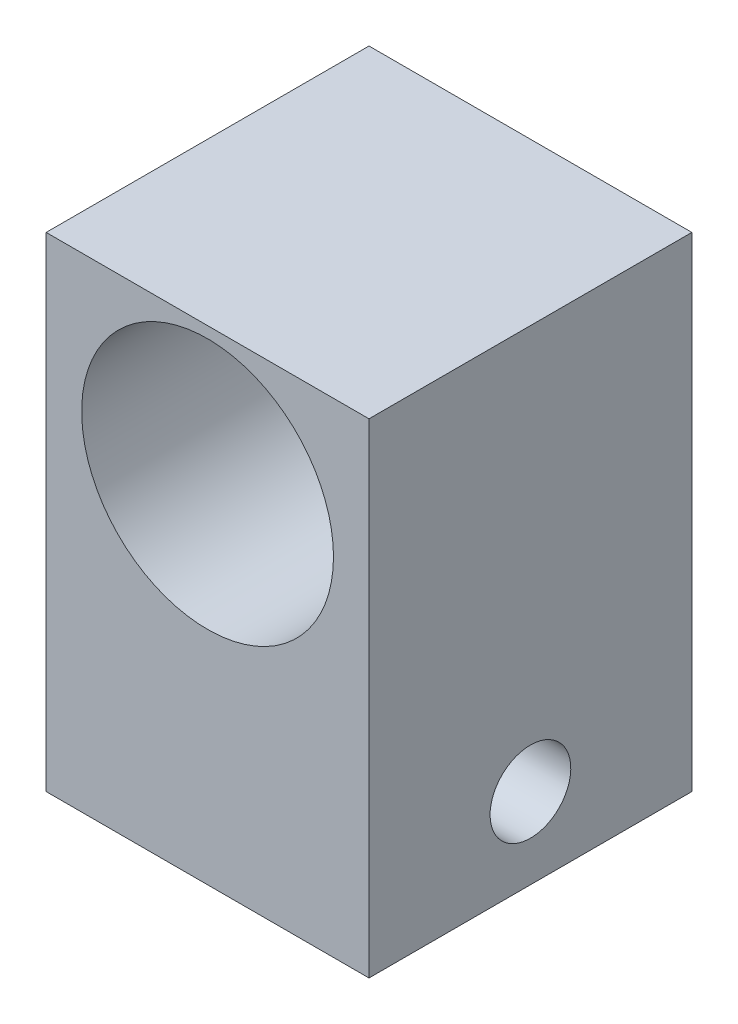
ISO-10303-21;
HEADER;
FILE_DESCRIPTION(('STEP AP214'),'2;1');
FILE_NAME('part.step','',(''),(''),'','','');
FILE_SCHEMA(('AUTOMOTIVE_DESIGN { 1 0 10303 214 1 1 1 1 }'));
ENDSEC;
DATA;
#1=APPLICATION_CONTEXT('core data for automotive mechanical design processes');
#2=APPLICATION_PROTOCOL_DEFINITION('international standard','automotive_design',2000,#1);
#3=PRODUCT_CONTEXT('',#1,'mechanical');
#4=PRODUCT('Part','Part','',(#3));
#5=PRODUCT_RELATED_PRODUCT_CATEGORY('part','',(#4));
#6=PRODUCT_DEFINITION_FORMATION('','',#4);
#7=PRODUCT_DEFINITION_CONTEXT('part definition',#1,'design');
#8=PRODUCT_DEFINITION('design','',#6,#7);
#9=PRODUCT_DEFINITION_SHAPE('','',#8);
#10=(LENGTH_UNIT() NAMED_UNIT(*) SI_UNIT(.MILLI.,.METRE.));
#11=(NAMED_UNIT(*) PLANE_ANGLE_UNIT() SI_UNIT($,.RADIAN.));
#12=(NAMED_UNIT(*) SI_UNIT($,.STERADIAN.) SOLID_ANGLE_UNIT());
#13=UNCERTAINTY_MEASURE_WITH_UNIT(LENGTH_MEASURE(1.E-05),#10,'distance_accuracy_value','');
#14=(GEOMETRIC_REPRESENTATION_CONTEXT(3) GLOBAL_UNCERTAINTY_ASSIGNED_CONTEXT((#13)) GLOBAL_UNIT_ASSIGNED_CONTEXT((#10,
#11,#12)) REPRESENTATION_CONTEXT('',''));
#15=CARTESIAN_POINT('',(0.,0.,0.));
#16=DIRECTION('',(0.,0.,1.));
#17=DIRECTION('',(1.,0.,0.));
#18=AXIS2_PLACEMENT_3D('',#15,#16,#17);
#19=CARTESIAN_POINT('',(-25.4,38.1,50.8));
#20=DIRECTION('',(1.,0.,0.));
#21=DIRECTION('',(0.,0.,-1.));
#22=AXIS2_PLACEMENT_3D('',#19,#20,#21);
#23=PLANE('',#22);
#24=CARTESIAN_POINT('',(-25.4,-25.4,25.4));
#25=DIRECTION('',(1.,0.,0.));
#26=DIRECTION('',(0.,1.,0.));
#27=AXIS2_PLACEMENT_3D('',#24,#25,#26);
#28=CIRCLE('',#27,6.35);
#29=CARTESIAN_POINT('',(-25.4,-19.05,25.4));
#30=VERTEX_POINT('',#29);
#31=EDGE_CURVE('E113',#30,#30,#28,.T.);
#32=ORIENTED_EDGE('',*,*,#31,.T.);
#33=EDGE_LOOP('',(#32));
#34=FACE_BOUND('',#33,.T.);
#35=DIRECTION('',(0.,-1.,0.));
#36=VECTOR('',#35,1.);
#37=CARTESIAN_POINT('',(-25.4,38.1,0.));
#38=LINE('',#37,#36);
#39=CARTESIAN_POINT('',(-25.4,38.1,0.));
#40=VERTEX_POINT('',#39);
#41=CARTESIAN_POINT('',(-25.4,-38.1,0.));
#42=VERTEX_POINT('',#41);
#43=EDGE_CURVE('E96',#40,#42,#38,.T.);
#44=ORIENTED_EDGE('',*,*,#43,.T.);
#45=DIRECTION('',(0.,0.,-1.));
#46=VECTOR('',#45,1.);
#47=CARTESIAN_POINT('',(-25.4,-38.1,50.8));
#48=LINE('',#47,#46);
#49=CARTESIAN_POINT('',(-25.4,-38.1,50.8));
#50=VERTEX_POINT('',#49);
#51=EDGE_CURVE('E11',#50,#42,#48,.T.);
#52=ORIENTED_EDGE('',*,*,#51,.F.);
#53=DIRECTION('',(0.,-1.,0.));
#54=VECTOR('',#53,1.);
#55=CARTESIAN_POINT('',(-25.4,38.1,50.8));
#56=LINE('',#55,#54);
#57=CARTESIAN_POINT('',(-25.4,38.1,50.8));
#58=VERTEX_POINT('',#57);
#59=EDGE_CURVE('E84',#58,#50,#56,.T.);
#60=ORIENTED_EDGE('',*,*,#59,.F.);
#61=DIRECTION('',(0.,0.,-1.));
#62=VECTOR('',#61,1.);
#63=CARTESIAN_POINT('',(-25.4,38.1,50.8));
#64=LINE('',#63,#62);
#65=EDGE_CURVE('E92',#58,#40,#64,.T.);
#66=ORIENTED_EDGE('',*,*,#65,.T.);
#67=EDGE_LOOP('',(#44,#52,#60,#66));
#68=FACE_BOUND('',#67,.T.);
#69=ADVANCED_FACE('F33',(#34,#68),#23,.F.);
#70=CARTESIAN_POINT('',(25.4,-38.1,50.8));
#71=DIRECTION('',(0.,1.,0.));
#72=DIRECTION('',(-1.,0.,0.));
#73=AXIS2_PLACEMENT_3D('',#70,#71,#72);
#74=PLANE('',#73);
#75=DIRECTION('',(1.,0.,0.));
#76=VECTOR('',#75,1.);
#77=CARTESIAN_POINT('',(25.4,-38.1,0.));
#78=LINE('',#77,#76);
#79=CARTESIAN_POINT('',(25.4,-38.1,0.));
#80=VERTEX_POINT('',#79);
#81=EDGE_CURVE('E88',#42,#80,#78,.T.);
#82=ORIENTED_EDGE('',*,*,#81,.T.);
#83=DIRECTION('',(0.,0.,-1.));
#84=VECTOR('',#83,1.);
#85=CARTESIAN_POINT('',(25.4,-38.1,50.8));
#86=LINE('',#85,#84);
#87=CARTESIAN_POINT('',(25.4,-38.1,50.8));
#88=VERTEX_POINT('',#87);
#89=EDGE_CURVE('E41',#88,#80,#86,.T.);
#90=ORIENTED_EDGE('',*,*,#89,.F.);
#91=DIRECTION('',(1.,0.,0.));
#92=VECTOR('',#91,1.);
#93=CARTESIAN_POINT('',(25.4,-38.1,50.8));
#94=LINE('',#93,#92);
#95=EDGE_CURVE('E79',#50,#88,#94,.T.);
#96=ORIENTED_EDGE('',*,*,#95,.F.);
#97=ORIENTED_EDGE('',*,*,#51,.T.);
#98=EDGE_LOOP('',(#82,#90,#96,#97));
#99=FACE_BOUND('',#98,.T.);
#100=ADVANCED_FACE('F87',(#99),#74,.F.);
#101=CARTESIAN_POINT('',(25.4,38.1,50.8));
#102=DIRECTION('',(-1.,0.,0.));
#103=DIRECTION('',(0.,-1.,0.));
#104=AXIS2_PLACEMENT_3D('',#101,#102,#103);
#105=PLANE('',#104);
#106=CARTESIAN_POINT('',(25.4,-25.4,25.4));
#107=DIRECTION('',(1.,0.,0.));
#108=DIRECTION('',(0.,1.,0.));
#109=AXIS2_PLACEMENT_3D('',#106,#107,#108);
#110=CIRCLE('',#109,6.35);
#111=CARTESIAN_POINT('',(25.4,-19.05,25.4));
#112=VERTEX_POINT('',#111);
#113=EDGE_CURVE('E116',#112,#112,#110,.T.);
#114=ORIENTED_EDGE('',*,*,#113,.F.);
#115=EDGE_LOOP('',(#114));
#116=FACE_BOUND('',#115,.T.);
#117=DIRECTION('',(0.,1.,0.));
#118=VECTOR('',#117,1.);
#119=CARTESIAN_POINT('',(25.4,38.1,0.));
#120=LINE('',#119,#118);
#121=CARTESIAN_POINT('',(25.4,38.1,0.));
#122=VERTEX_POINT('',#121);
#123=EDGE_CURVE('E66',#80,#122,#120,.T.);
#124=ORIENTED_EDGE('',*,*,#123,.T.);
#125=DIRECTION('',(0.,0.,-1.));
#126=VECTOR('',#125,1.);
#127=CARTESIAN_POINT('',(25.4,38.1,50.8));
#128=LINE('',#127,#126);
#129=CARTESIAN_POINT('',(25.4,38.1,50.8));
#130=VERTEX_POINT('',#129);
#131=EDGE_CURVE('E89',#130,#122,#128,.T.);
#132=ORIENTED_EDGE('',*,*,#131,.F.);
#133=DIRECTION('',(0.,1.,0.));
#134=VECTOR('',#133,1.);
#135=CARTESIAN_POINT('',(25.4,38.1,50.8));
#136=LINE('',#135,#134);
#137=EDGE_CURVE('E82',#88,#130,#136,.T.);
#138=ORIENTED_EDGE('',*,*,#137,.F.);
#139=ORIENTED_EDGE('',*,*,#89,.T.);
#140=EDGE_LOOP('',(#124,#132,#138,#139));
#141=FACE_BOUND('',#140,.T.);
#142=ADVANCED_FACE('F90',(#116,#141),#105,.F.);
#143=CARTESIAN_POINT('',(25.4,38.1,50.8));
#144=DIRECTION('',(0.,-1.,0.));
#145=DIRECTION('',(1.,0.,0.));
#146=AXIS2_PLACEMENT_3D('',#143,#144,#145);
#147=PLANE('',#146);
#148=DIRECTION('',(-1.,0.,0.));
#149=VECTOR('',#148,1.);
#150=CARTESIAN_POINT('',(25.4,38.1,0.));
#151=LINE('',#150,#149);
#152=EDGE_CURVE('E72',#122,#40,#151,.T.);
#153=ORIENTED_EDGE('',*,*,#152,.T.);
#154=ORIENTED_EDGE('',*,*,#65,.F.);
#155=DIRECTION('',(-1.,0.,0.));
#156=VECTOR('',#155,1.);
#157=CARTESIAN_POINT('',(25.4,38.1,50.8));
#158=LINE('',#157,#156);
#159=EDGE_CURVE('E49',#130,#58,#158,.T.);
#160=ORIENTED_EDGE('',*,*,#159,.F.);
#161=ORIENTED_EDGE('',*,*,#131,.T.);
#162=EDGE_LOOP('',(#153,#154,#160,#161));
#163=FACE_BOUND('',#162,.T.);
#164=ADVANCED_FACE('F104',(#163),#147,.F.);
#165=CARTESIAN_POINT('',(0.,0.,50.8));
#166=DIRECTION('',(0.,0.,-1.));
#167=DIRECTION('',(-1.,0.,0.));
#168=AXIS2_PLACEMENT_3D('',#165,#166,#167);
#169=PLANE('',#168);
#170=CARTESIAN_POINT('',(0.,16.51,50.8));
#171=DIRECTION('',(0.,0.,1.));
#172=DIRECTION('',(1.,0.,0.));
#173=AXIS2_PLACEMENT_3D('',#170,#171,#172);
#174=CIRCLE('',#173,19.812);
#175=CARTESIAN_POINT('',(19.812,16.51,50.8));
#176=VERTEX_POINT('',#175);
#177=EDGE_CURVE('E110',#176,#176,#174,.T.);
#178=ORIENTED_EDGE('',*,*,#177,.F.);
#179=EDGE_LOOP('',(#178));
#180=FACE_BOUND('',#179,.T.);
#181=ORIENTED_EDGE('',*,*,#59,.T.);
#182=ORIENTED_EDGE('',*,*,#95,.T.);
#183=ORIENTED_EDGE('',*,*,#137,.T.);
#184=ORIENTED_EDGE('',*,*,#159,.T.);
#185=EDGE_LOOP('',(#181,#182,#183,#184));
#186=FACE_BOUND('',#185,.T.);
#187=ADVANCED_FACE('F80',(#180,#186),#169,.F.);
#188=CARTESIAN_POINT('',(0.,0.,0.));
#189=DIRECTION('',(0.,0.,-1.));
#190=DIRECTION('',(-1.,0.,0.));
#191=AXIS2_PLACEMENT_3D('',#188,#189,#190);
#192=PLANE('',#191);
#193=CARTESIAN_POINT('',(0.,16.51,0.));
#194=DIRECTION('',(0.,0.,1.));
#195=DIRECTION('',(1.,0.,0.));
#196=AXIS2_PLACEMENT_3D('',#193,#194,#195);
#197=CIRCLE('',#196,19.812);
#198=CARTESIAN_POINT('',(19.812,16.51,0.));
#199=VERTEX_POINT('',#198);
#200=EDGE_CURVE('E99',#199,#199,#197,.T.);
#201=ORIENTED_EDGE('',*,*,#200,.T.);
#202=EDGE_LOOP('',(#201));
#203=FACE_BOUND('',#202,.T.);
#204=ORIENTED_EDGE('',*,*,#43,.F.);
#205=ORIENTED_EDGE('',*,*,#152,.F.);
#206=ORIENTED_EDGE('',*,*,#123,.F.);
#207=ORIENTED_EDGE('',*,*,#81,.F.);
#208=EDGE_LOOP('',(#204,#205,#206,#207));
#209=FACE_BOUND('',#208,.T.);
#210=ADVANCED_FACE('F107',(#203,#209),#192,.T.);
#211=CARTESIAN_POINT('',(0.,16.51,0.));
#212=DIRECTION('',(0.,0.,1.));
#213=DIRECTION('',(1.,0.,0.));
#214=AXIS2_PLACEMENT_3D('',#211,#212,#213);
#215=CYLINDRICAL_SURFACE('',#214,19.812);
#216=ORIENTED_EDGE('',*,*,#200,.F.);
#217=EDGE_LOOP('',(#216));
#218=FACE_BOUND('',#217,.T.);
#219=ORIENTED_EDGE('',*,*,#177,.T.);
#220=EDGE_LOOP('',(#219));
#221=FACE_BOUND('',#220,.T.);
#222=ADVANCED_FACE('F126',(#218,#221),#215,.F.);
#223=CARTESIAN_POINT('',(-25.4,-25.4,25.4));
#224=DIRECTION('',(1.,0.,0.));
#225=DIRECTION('',(0.,1.,0.));
#226=AXIS2_PLACEMENT_3D('',#223,#224,#225);
#227=CYLINDRICAL_SURFACE('',#226,6.35);
#228=ORIENTED_EDGE('',*,*,#31,.F.);
#229=EDGE_LOOP('',(#228));
#230=FACE_BOUND('',#229,.T.);
#231=ORIENTED_EDGE('',*,*,#113,.T.);
#232=EDGE_LOOP('',(#231));
#233=FACE_BOUND('',#232,.T.);
#234=ADVANCED_FACE('F123',(#230,#233),#227,.F.);
#235=CLOSED_SHELL('',(#69,#100,#142,#164,#187,#210,#222,#234));
#236=MANIFOLD_SOLID_BREP('B2',#235);
#237=ADVANCED_BREP_SHAPE_REPRESENTATION('',(#18,#236),#14);
#238=SHAPE_DEFINITION_REPRESENTATION(#9,#237);
ENDSEC;
END-ISO-10303-21;
